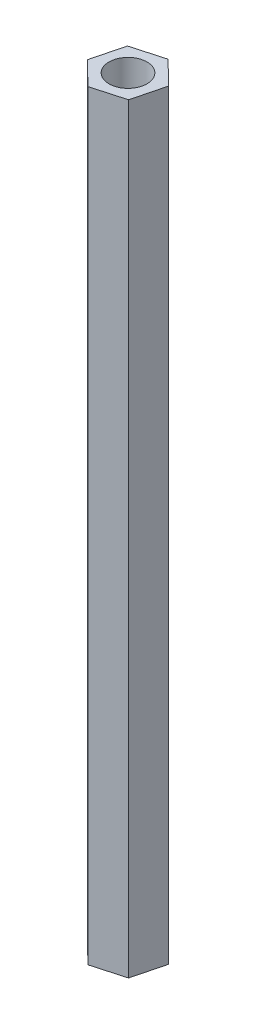
ISO-10303-21;
HEADER;
FILE_DESCRIPTION(('STEP AP214'),'2;1');
FILE_NAME('part.step','',(''),(''),'','','');
FILE_SCHEMA(('AUTOMOTIVE_DESIGN { 1 0 10303 214 1 1 1 1 }'));
ENDSEC;
DATA;
#1=APPLICATION_CONTEXT('core data for automotive mechanical design processes');
#2=APPLICATION_PROTOCOL_DEFINITION('international standard','automotive_design',2000,#1);
#3=PRODUCT_CONTEXT('',#1,'mechanical');
#4=PRODUCT('Part','Part','',(#3));
#5=PRODUCT_RELATED_PRODUCT_CATEGORY('part','',(#4));
#6=PRODUCT_DEFINITION_FORMATION('','',#4);
#7=PRODUCT_DEFINITION_CONTEXT('part definition',#1,'design');
#8=PRODUCT_DEFINITION('design','',#6,#7);
#9=PRODUCT_DEFINITION_SHAPE('','',#8);
#10=(LENGTH_UNIT() NAMED_UNIT(*) SI_UNIT(.MILLI.,.METRE.));
#11=(NAMED_UNIT(*) PLANE_ANGLE_UNIT() SI_UNIT($,.RADIAN.));
#12=(NAMED_UNIT(*) SI_UNIT($,.STERADIAN.) SOLID_ANGLE_UNIT());
#13=UNCERTAINTY_MEASURE_WITH_UNIT(LENGTH_MEASURE(1.E-05),#10,'distance_accuracy_value','');
#14=(GEOMETRIC_REPRESENTATION_CONTEXT(3) GLOBAL_UNCERTAINTY_ASSIGNED_CONTEXT((#13)) GLOBAL_UNIT_ASSIGNED_CONTEXT((#10,
#11,#12)) REPRESENTATION_CONTEXT('',''));
#15=CARTESIAN_POINT('',(0.,0.,0.));
#16=DIRECTION('',(0.,0.,1.));
#17=DIRECTION('',(1.,0.,0.));
#18=AXIS2_PLACEMENT_3D('',#15,#16,#17);
#19=CARTESIAN_POINT('',(0.,80.,0.));
#20=DIRECTION('',(0.,1.,0.));
#21=DIRECTION('',(0.,0.,1.));
#22=AXIS2_PLACEMENT_3D('',#19,#20,#21);
#23=PLANE('',#22);
#24=DIRECTION('',(0.962814267906902,0.,-0.270164182516661));
#25=VECTOR('',#24,1.);
#26=CARTESIAN_POINT('',(-1.40464579642075,80.,2.83770131282133));
#27=LINE('',#26,#25);
#28=CARTESIAN_POINT('',(-1.40464579642075,80.,2.83770131282133));
#29=VERTEX_POINT('',#28);
#30=CARTESIAN_POINT('',(1.93064066411323,80.,1.90182513181299));
#31=VERTEX_POINT('',#30);
#32=EDGE_CURVE('E150',#29,#31,#27,.T.);
#33=ORIENTED_EDGE('',*,*,#32,.T.);
#34=DIRECTION('',(0.247438088701366,0.,-0.968903706391824));
#35=VECTOR('',#34,1.);
#36=CARTESIAN_POINT('',(1.93064066411323,80.,1.90182513181299));
#37=LINE('',#36,#35);
#38=CARTESIAN_POINT('',(2.78779134683023,80.,-1.45455576241189));
#39=VERTEX_POINT('',#38);
#40=EDGE_CURVE('E98',#31,#39,#37,.T.);
#41=ORIENTED_EDGE('',*,*,#40,.T.);
#42=DIRECTION('',(-0.715376179205536,0.,-0.698739523875163));
#43=VECTOR('',#42,1.);
#44=CARTESIAN_POINT('',(2.78779134683023,80.,-1.45455576241189));
#45=LINE('',#44,#43);
#46=CARTESIAN_POINT('',(0.309655569013258,80.,-3.87506047562842));
#47=VERTEX_POINT('',#46);
#48=EDGE_CURVE('E111',#39,#47,#45,.T.);
#49=ORIENTED_EDGE('',*,*,#48,.T.);
#50=DIRECTION('',(-0.962814267906902,0.,0.270164182516661));
#51=VECTOR('',#50,1.);
#52=CARTESIAN_POINT('',(0.309655569013258,80.,-3.87506047562842));
#53=LINE('',#52,#51);
#54=CARTESIAN_POINT('',(-3.02563089152072,80.,-2.93918429462009));
#55=VERTEX_POINT('',#54);
#56=EDGE_CURVE('E105',#47,#55,#53,.T.);
#57=ORIENTED_EDGE('',*,*,#56,.T.);
#58=DIRECTION('',(-0.247438088701366,0.,0.968903706391824));
#59=VECTOR('',#58,1.);
#60=CARTESIAN_POINT('',(-3.02563089152072,80.,-2.93918429462009));
#61=LINE('',#60,#59);
#62=CARTESIAN_POINT('',(-3.88278157423772,80.,0.417196599604788));
#63=VERTEX_POINT('',#62);
#64=EDGE_CURVE('E109',#55,#63,#61,.T.);
#65=ORIENTED_EDGE('',*,*,#64,.T.);
#66=DIRECTION('',(0.715376179205536,0.,0.698739523875163));
#67=VECTOR('',#66,1.);
#68=CARTESIAN_POINT('',(-3.88278157423772,80.,0.417196599604788));
#69=LINE('',#68,#67);
#70=EDGE_CURVE('E61',#63,#29,#69,.T.);
#71=ORIENTED_EDGE('',*,*,#70,.T.);
#72=EDGE_LOOP('',(#33,#41,#49,#57,#65,#71));
#73=FACE_BOUND('',#72,.T.);
#74=CARTESIAN_POINT('',(-0.547495113703745,80.,-0.518679581403549));
#75=DIRECTION('',(0.,1.,0.));
#76=DIRECTION('',(0.,0.,1.));
#77=AXIS2_PLACEMENT_3D('',#74,#75,#76);
#78=CIRCLE('',#77,2.);
#79=CARTESIAN_POINT('',(-0.547495113703745,80.,1.48132041859645));
#80=VERTEX_POINT('',#79);
#81=EDGE_CURVE('E138',#80,#80,#78,.T.);
#82=ORIENTED_EDGE('',*,*,#81,.F.);
#83=EDGE_LOOP('',(#82));
#84=FACE_BOUND('',#83,.T.);
#85=ADVANCED_FACE('F43',(#73,#84),#23,.T.);
#86=CARTESIAN_POINT('',(0.,0.,0.));
#87=DIRECTION('',(0.,1.,0.));
#88=DIRECTION('',(0.,0.,1.));
#89=AXIS2_PLACEMENT_3D('',#86,#87,#88);
#90=PLANE('',#89);
#91=DIRECTION('',(0.962814267906902,0.,-0.270164182516661));
#92=VECTOR('',#91,1.);
#93=CARTESIAN_POINT('',(-1.40464579642075,0.,2.83770131282133));
#94=LINE('',#93,#92);
#95=CARTESIAN_POINT('',(-1.40464579642075,0.,2.83770131282133));
#96=VERTEX_POINT('',#95);
#97=CARTESIAN_POINT('',(1.93064066411323,0.,1.90182513181299));
#98=VERTEX_POINT('',#97);
#99=EDGE_CURVE('E133',#96,#98,#94,.T.);
#100=ORIENTED_EDGE('',*,*,#99,.F.);
#101=DIRECTION('',(0.715376179205536,0.,0.698739523875163));
#102=VECTOR('',#101,1.);
#103=CARTESIAN_POINT('',(-3.88278157423772,0.,0.417196599604788));
#104=LINE('',#103,#102);
#105=CARTESIAN_POINT('',(-3.88278157423772,0.,0.417196599604788));
#106=VERTEX_POINT('',#105);
#107=EDGE_CURVE('E90',#106,#96,#104,.T.);
#108=ORIENTED_EDGE('',*,*,#107,.F.);
#109=DIRECTION('',(-0.247438088701366,0.,0.968903706391824));
#110=VECTOR('',#109,1.);
#111=CARTESIAN_POINT('',(-3.02563089152072,0.,-2.93918429462009));
#112=LINE('',#111,#110);
#113=CARTESIAN_POINT('',(-3.02563089152072,0.,-2.93918429462009));
#114=VERTEX_POINT('',#113);
#115=EDGE_CURVE('E84',#114,#106,#112,.T.);
#116=ORIENTED_EDGE('',*,*,#115,.F.);
#117=DIRECTION('',(-0.962814267906902,0.,0.270164182516661));
#118=VECTOR('',#117,1.);
#119=CARTESIAN_POINT('',(0.309655569013258,0.,-3.87506047562842));
#120=LINE('',#119,#118);
#121=CARTESIAN_POINT('',(0.309655569013258,0.,-3.87506047562842));
#122=VERTEX_POINT('',#121);
#123=EDGE_CURVE('E120',#122,#114,#120,.T.);
#124=ORIENTED_EDGE('',*,*,#123,.F.);
#125=DIRECTION('',(-0.715376179205536,0.,-0.698739523875163));
#126=VECTOR('',#125,1.);
#127=CARTESIAN_POINT('',(2.78779134683023,0.,-1.45455576241189));
#128=LINE('',#127,#126);
#129=CARTESIAN_POINT('',(2.78779134683023,0.,-1.45455576241189));
#130=VERTEX_POINT('',#129);
#131=EDGE_CURVE('E141',#130,#122,#128,.T.);
#132=ORIENTED_EDGE('',*,*,#131,.F.);
#133=DIRECTION('',(0.247438088701366,0.,-0.968903706391824));
#134=VECTOR('',#133,1.);
#135=CARTESIAN_POINT('',(1.93064066411323,0.,1.90182513181299));
#136=LINE('',#135,#134);
#137=EDGE_CURVE('E137',#98,#130,#136,.T.);
#138=ORIENTED_EDGE('',*,*,#137,.F.);
#139=EDGE_LOOP('',(#100,#108,#116,#124,#132,#138));
#140=FACE_BOUND('',#139,.T.);
#141=CARTESIAN_POINT('',(-0.547495113703745,0.,-0.518679581403549));
#142=DIRECTION('',(0.,1.,0.));
#143=DIRECTION('',(0.,0.,1.));
#144=AXIS2_PLACEMENT_3D('',#141,#142,#143);
#145=CIRCLE('',#144,2.);
#146=CARTESIAN_POINT('',(-0.547495113703745,0.,1.48132041859645));
#147=VERTEX_POINT('',#146);
#148=EDGE_CURVE('E265',#147,#147,#145,.T.);
#149=ORIENTED_EDGE('',*,*,#148,.T.);
#150=EDGE_LOOP('',(#149));
#151=FACE_BOUND('',#150,.T.);
#152=ADVANCED_FACE('F163',(#140,#151),#90,.F.);
#153=CARTESIAN_POINT('',(-1.40464579642075,80.,2.83770131282133));
#154=DIRECTION('',(-0.270164182516661,0.,-0.962814267906902));
#155=DIRECTION('',(-0.962814267906902,0.,0.270164182516661));
#156=AXIS2_PLACEMENT_3D('',#153,#154,#155);
#157=PLANE('',#156);
#158=ORIENTED_EDGE('',*,*,#99,.T.);
#159=DIRECTION('',(0.,-1.,0.));
#160=VECTOR('',#159,1.);
#161=CARTESIAN_POINT('',(1.93064066411323,80.,1.90182513181299));
#162=LINE('',#161,#160);
#163=EDGE_CURVE('E11',#31,#98,#162,.T.);
#164=ORIENTED_EDGE('',*,*,#163,.F.);
#165=ORIENTED_EDGE('',*,*,#32,.F.);
#166=DIRECTION('',(0.,-1.,0.));
#167=VECTOR('',#166,1.);
#168=CARTESIAN_POINT('',(-1.40464579642075,80.,2.83770131282133));
#169=LINE('',#168,#167);
#170=EDGE_CURVE('E129',#29,#96,#169,.T.);
#171=ORIENTED_EDGE('',*,*,#170,.T.);
#172=EDGE_LOOP('',(#158,#164,#165,#171));
#173=FACE_BOUND('',#172,.T.);
#174=ADVANCED_FACE('F45',(#173),#157,.F.);
#175=CARTESIAN_POINT('',(1.93064066411323,80.,1.90182513181299));
#176=DIRECTION('',(-0.968903706391824,0.,-0.247438088701366));
#177=DIRECTION('',(-0.247438088701366,0.,0.968903706391824));
#178=AXIS2_PLACEMENT_3D('',#175,#176,#177);
#179=PLANE('',#178);
#180=ORIENTED_EDGE('',*,*,#137,.T.);
#181=DIRECTION('',(0.,-1.,0.));
#182=VECTOR('',#181,1.);
#183=CARTESIAN_POINT('',(2.78779134683023,80.,-1.45455576241189));
#184=LINE('',#183,#182);
#185=EDGE_CURVE('E53',#39,#130,#184,.T.);
#186=ORIENTED_EDGE('',*,*,#185,.F.);
#187=ORIENTED_EDGE('',*,*,#40,.F.);
#188=ORIENTED_EDGE('',*,*,#163,.T.);
#189=EDGE_LOOP('',(#180,#186,#187,#188));
#190=FACE_BOUND('',#189,.T.);
#191=ADVANCED_FACE('F188',(#190),#179,.F.);
#192=CARTESIAN_POINT('',(2.78779134683023,80.,-1.45455576241189));
#193=DIRECTION('',(-0.698739523875163,0.,0.715376179205536));
#194=DIRECTION('',(0.715376179205536,0.,0.698739523875163));
#195=AXIS2_PLACEMENT_3D('',#192,#193,#194);
#196=PLANE('',#195);
#197=ORIENTED_EDGE('',*,*,#131,.T.);
#198=DIRECTION('',(0.,-1.,0.));
#199=VECTOR('',#198,1.);
#200=CARTESIAN_POINT('',(0.309655569013258,80.,-3.87506047562842));
#201=LINE('',#200,#199);
#202=EDGE_CURVE('E122',#47,#122,#201,.T.);
#203=ORIENTED_EDGE('',*,*,#202,.F.);
#204=ORIENTED_EDGE('',*,*,#48,.F.);
#205=ORIENTED_EDGE('',*,*,#185,.T.);
#206=EDGE_LOOP('',(#197,#203,#204,#205));
#207=FACE_BOUND('',#206,.T.);
#208=ADVANCED_FACE('F160',(#207),#196,.F.);
#209=CARTESIAN_POINT('',(0.309655569013258,80.,-3.87506047562842));
#210=DIRECTION('',(0.270164182516661,0.,0.962814267906902));
#211=DIRECTION('',(0.962814267906902,0.,-0.270164182516661));
#212=AXIS2_PLACEMENT_3D('',#209,#210,#211);
#213=PLANE('',#212);
#214=ORIENTED_EDGE('',*,*,#123,.T.);
#215=DIRECTION('',(0.,-1.,0.));
#216=VECTOR('',#215,1.);
#217=CARTESIAN_POINT('',(-3.02563089152072,80.,-2.93918429462009));
#218=LINE('',#217,#216);
#219=EDGE_CURVE('E117',#55,#114,#218,.T.);
#220=ORIENTED_EDGE('',*,*,#219,.F.);
#221=ORIENTED_EDGE('',*,*,#56,.F.);
#222=ORIENTED_EDGE('',*,*,#202,.T.);
#223=EDGE_LOOP('',(#214,#220,#221,#222));
#224=FACE_BOUND('',#223,.T.);
#225=ADVANCED_FACE('F118',(#224),#213,.F.);
#226=CARTESIAN_POINT('',(-3.02563089152072,80.,-2.93918429462009));
#227=DIRECTION('',(0.968903706391824,0.,0.247438088701366));
#228=DIRECTION('',(0.247438088701366,0.,-0.968903706391824));
#229=AXIS2_PLACEMENT_3D('',#226,#227,#228);
#230=PLANE('',#229);
#231=ORIENTED_EDGE('',*,*,#115,.T.);
#232=DIRECTION('',(0.,-1.,0.));
#233=VECTOR('',#232,1.);
#234=CARTESIAN_POINT('',(-3.88278157423772,80.,0.417196599604788));
#235=LINE('',#234,#233);
#236=EDGE_CURVE('E123',#63,#106,#235,.T.);
#237=ORIENTED_EDGE('',*,*,#236,.F.);
#238=ORIENTED_EDGE('',*,*,#64,.F.);
#239=ORIENTED_EDGE('',*,*,#219,.T.);
#240=EDGE_LOOP('',(#231,#237,#238,#239));
#241=FACE_BOUND('',#240,.T.);
#242=ADVANCED_FACE('F125',(#241),#230,.F.);
#243=CARTESIAN_POINT('',(-3.88278157423772,80.,0.417196599604788));
#244=DIRECTION('',(0.698739523875163,0.,-0.715376179205536));
#245=DIRECTION('',(-0.715376179205536,0.,-0.698739523875163));
#246=AXIS2_PLACEMENT_3D('',#243,#244,#245);
#247=PLANE('',#246);
#248=ORIENTED_EDGE('',*,*,#107,.T.);
#249=ORIENTED_EDGE('',*,*,#170,.F.);
#250=ORIENTED_EDGE('',*,*,#70,.F.);
#251=ORIENTED_EDGE('',*,*,#236,.T.);
#252=EDGE_LOOP('',(#248,#249,#250,#251));
#253=FACE_BOUND('',#252,.T.);
#254=ADVANCED_FACE('F168',(#253),#247,.F.);
#255=CARTESIAN_POINT('',(-0.547495113703745,80.,-0.518679581403549));
#256=DIRECTION('',(0.,-1.,0.));
#257=DIRECTION('',(0.,0.,-1.));
#258=AXIS2_PLACEMENT_3D('',#255,#256,#257);
#259=CYLINDRICAL_SURFACE('',#258,2.);
#260=ORIENTED_EDGE('',*,*,#81,.T.);
#261=EDGE_LOOP('',(#260));
#262=FACE_BOUND('',#261,.T.);
#263=ORIENTED_EDGE('',*,*,#148,.F.);
#264=EDGE_LOOP('',(#263));
#265=FACE_BOUND('',#264,.T.);
#266=ADVANCED_FACE('F170',(#262,#265),#259,.F.);
#267=CLOSED_SHELL('',(#85,#152,#174,#191,#208,#225,#242,#254,#266));
#268=MANIFOLD_SOLID_BREP('B2',#267);
#269=ADVANCED_BREP_SHAPE_REPRESENTATION('',(#18,#268),#14);
#270=SHAPE_DEFINITION_REPRESENTATION(#9,#269);
ENDSEC;
END-ISO-10303-21;
